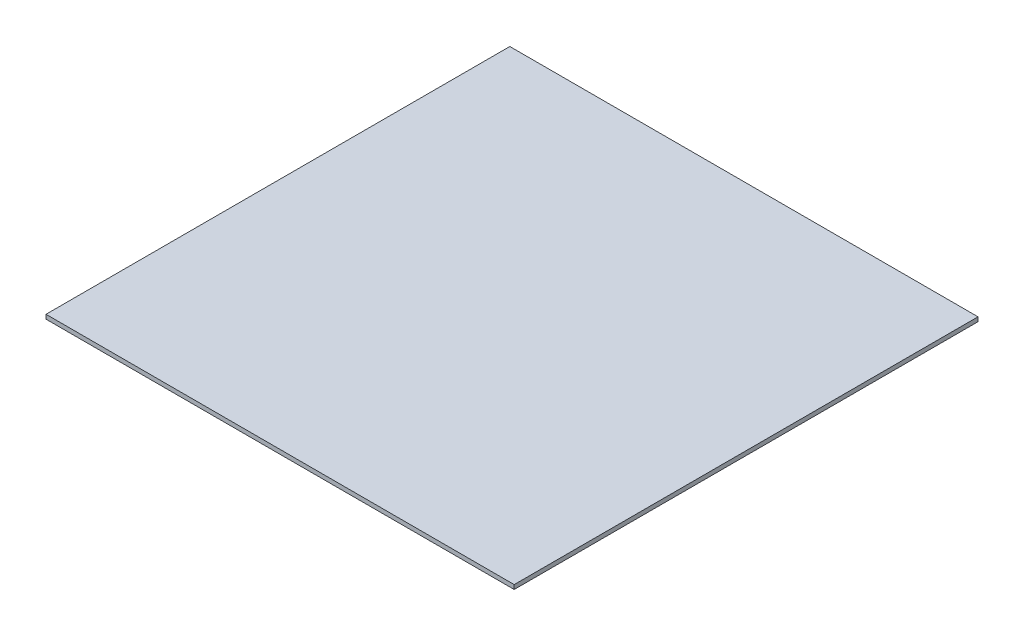
ISO-10303-21;
HEADER;
FILE_DESCRIPTION(('STEP AP214'),'2;1');
FILE_NAME('part.step','',(''),(''),'','','');
FILE_SCHEMA(('AUTOMOTIVE_DESIGN { 1 0 10303 214 1 1 1 1 }'));
ENDSEC;
DATA;
#1=APPLICATION_CONTEXT('core data for automotive mechanical design processes');
#2=APPLICATION_PROTOCOL_DEFINITION('international standard','automotive_design',2000,#1);
#3=PRODUCT_CONTEXT('',#1,'mechanical');
#4=PRODUCT('Part','Part','',(#3));
#5=PRODUCT_RELATED_PRODUCT_CATEGORY('part','',(#4));
#6=PRODUCT_DEFINITION_FORMATION('','',#4);
#7=PRODUCT_DEFINITION_CONTEXT('part definition',#1,'design');
#8=PRODUCT_DEFINITION('design','',#6,#7);
#9=PRODUCT_DEFINITION_SHAPE('','',#8);
#10=(LENGTH_UNIT() NAMED_UNIT(*) SI_UNIT(.MILLI.,.METRE.));
#11=(NAMED_UNIT(*) PLANE_ANGLE_UNIT() SI_UNIT($,.RADIAN.));
#12=(NAMED_UNIT(*) SI_UNIT($,.STERADIAN.) SOLID_ANGLE_UNIT());
#13=UNCERTAINTY_MEASURE_WITH_UNIT(LENGTH_MEASURE(1.E-05),#10,'distance_accuracy_value','');
#14=(GEOMETRIC_REPRESENTATION_CONTEXT(3) GLOBAL_UNCERTAINTY_ASSIGNED_CONTEXT((#13)) GLOBAL_UNIT_ASSIGNED_CONTEXT((#10,
#11,#12)) REPRESENTATION_CONTEXT('',''));
#15=CARTESIAN_POINT('',(0.,0.,0.));
#16=DIRECTION('',(0.,0.,1.));
#17=DIRECTION('',(1.,0.,0.));
#18=AXIS2_PLACEMENT_3D('',#15,#16,#17);
#19=CARTESIAN_POINT('',(304.8,5.55625,301.9425));
#20=DIRECTION('',(-1.,0.,0.));
#21=DIRECTION('',(0.,0.,1.));
#22=AXIS2_PLACEMENT_3D('',#19,#20,#21);
#23=PLANE('',#22);
#24=DIRECTION('',(0.,0.,-1.));
#25=VECTOR('',#24,1.);
#26=CARTESIAN_POINT('',(304.8,0.,301.9425));
#27=LINE('',#26,#25);
#28=CARTESIAN_POINT('',(304.8,0.,301.9425));
#29=VERTEX_POINT('',#28);
#30=CARTESIAN_POINT('',(304.8,0.,-301.9425));
#31=VERTEX_POINT('',#30);
#32=EDGE_CURVE('E103',#29,#31,#27,.T.);
#33=ORIENTED_EDGE('',*,*,#32,.T.);
#34=DIRECTION('',(0.,-1.,0.));
#35=VECTOR('',#34,1.);
#36=CARTESIAN_POINT('',(304.8,5.55625,-301.9425));
#37=LINE('',#36,#35);
#38=CARTESIAN_POINT('',(304.8,5.55625,-301.9425));
#39=VERTEX_POINT('',#38);
#40=EDGE_CURVE('E11',#39,#31,#37,.T.);
#41=ORIENTED_EDGE('',*,*,#40,.F.);
#42=DIRECTION('',(0.,0.,-1.));
#43=VECTOR('',#42,1.);
#44=CARTESIAN_POINT('',(304.8,5.55625,301.9425));
#45=LINE('',#44,#43);
#46=CARTESIAN_POINT('',(304.8,5.55625,301.9425));
#47=VERTEX_POINT('',#46);
#48=EDGE_CURVE('E91',#47,#39,#45,.T.);
#49=ORIENTED_EDGE('',*,*,#48,.F.);
#50=DIRECTION('',(0.,-1.,0.));
#51=VECTOR('',#50,1.);
#52=CARTESIAN_POINT('',(304.8,5.55625,301.9425));
#53=LINE('',#52,#51);
#54=EDGE_CURVE('E99',#47,#29,#53,.T.);
#55=ORIENTED_EDGE('',*,*,#54,.T.);
#56=EDGE_LOOP('',(#33,#41,#49,#55));
#57=FACE_BOUND('',#56,.T.);
#58=ADVANCED_FACE('F40',(#57),#23,.F.);
#59=CARTESIAN_POINT('',(-304.8,5.55625,-301.9425));
#60=DIRECTION('',(0.,0.,1.));
#61=DIRECTION('',(1.,0.,0.));
#62=AXIS2_PLACEMENT_3D('',#59,#60,#61);
#63=PLANE('',#62);
#64=DIRECTION('',(-1.,0.,0.));
#65=VECTOR('',#64,1.);
#66=CARTESIAN_POINT('',(-304.8,0.,-301.9425));
#67=LINE('',#66,#65);
#68=CARTESIAN_POINT('',(-304.8,0.,-301.9425));
#69=VERTEX_POINT('',#68);
#70=EDGE_CURVE('E95',#31,#69,#67,.T.);
#71=ORIENTED_EDGE('',*,*,#70,.T.);
#72=DIRECTION('',(0.,-1.,0.));
#73=VECTOR('',#72,1.);
#74=CARTESIAN_POINT('',(-304.8,5.55625,-301.9425));
#75=LINE('',#74,#73);
#76=CARTESIAN_POINT('',(-304.8,5.55625,-301.9425));
#77=VERTEX_POINT('',#76);
#78=EDGE_CURVE('E48',#77,#69,#75,.T.);
#79=ORIENTED_EDGE('',*,*,#78,.F.);
#80=DIRECTION('',(-1.,0.,0.));
#81=VECTOR('',#80,1.);
#82=CARTESIAN_POINT('',(-304.8,5.55625,-301.9425));
#83=LINE('',#82,#81);
#84=EDGE_CURVE('E86',#39,#77,#83,.T.);
#85=ORIENTED_EDGE('',*,*,#84,.F.);
#86=ORIENTED_EDGE('',*,*,#40,.T.);
#87=EDGE_LOOP('',(#71,#79,#85,#86));
#88=FACE_BOUND('',#87,.T.);
#89=ADVANCED_FACE('F94',(#88),#63,.F.);
#90=CARTESIAN_POINT('',(-304.8,5.55625,301.9425));
#91=DIRECTION('',(1.,0.,0.));
#92=DIRECTION('',(0.,0.,-1.));
#93=AXIS2_PLACEMENT_3D('',#90,#91,#92);
#94=PLANE('',#93);
#95=DIRECTION('',(0.,0.,1.));
#96=VECTOR('',#95,1.);
#97=CARTESIAN_POINT('',(-304.8,0.,301.9425));
#98=LINE('',#97,#96);
#99=CARTESIAN_POINT('',(-304.8,0.,301.9425));
#100=VERTEX_POINT('',#99);
#101=EDGE_CURVE('E73',#69,#100,#98,.T.);
#102=ORIENTED_EDGE('',*,*,#101,.T.);
#103=DIRECTION('',(0.,-1.,0.));
#104=VECTOR('',#103,1.);
#105=CARTESIAN_POINT('',(-304.8,5.55625,301.9425));
#106=LINE('',#105,#104);
#107=CARTESIAN_POINT('',(-304.8,5.55625,301.9425));
#108=VERTEX_POINT('',#107);
#109=EDGE_CURVE('E96',#108,#100,#106,.T.);
#110=ORIENTED_EDGE('',*,*,#109,.F.);
#111=DIRECTION('',(0.,0.,1.));
#112=VECTOR('',#111,1.);
#113=CARTESIAN_POINT('',(-304.8,5.55625,301.9425));
#114=LINE('',#113,#112);
#115=EDGE_CURVE('E89',#77,#108,#114,.T.);
#116=ORIENTED_EDGE('',*,*,#115,.F.);
#117=ORIENTED_EDGE('',*,*,#78,.T.);
#118=EDGE_LOOP('',(#102,#110,#116,#117));
#119=FACE_BOUND('',#118,.T.);
#120=ADVANCED_FACE('F97',(#119),#94,.F.);
#121=CARTESIAN_POINT('',(-304.8,5.55625,301.9425));
#122=DIRECTION('',(0.,0.,-1.));
#123=DIRECTION('',(-1.,0.,0.));
#124=AXIS2_PLACEMENT_3D('',#121,#122,#123);
#125=PLANE('',#124);
#126=DIRECTION('',(1.,0.,0.));
#127=VECTOR('',#126,1.);
#128=CARTESIAN_POINT('',(-304.8,0.,301.9425));
#129=LINE('',#128,#127);
#130=EDGE_CURVE('E79',#100,#29,#129,.T.);
#131=ORIENTED_EDGE('',*,*,#130,.T.);
#132=ORIENTED_EDGE('',*,*,#54,.F.);
#133=DIRECTION('',(1.,0.,0.));
#134=VECTOR('',#133,1.);
#135=CARTESIAN_POINT('',(-304.8,5.55625,301.9425));
#136=LINE('',#135,#134);
#137=EDGE_CURVE('E56',#108,#47,#136,.T.);
#138=ORIENTED_EDGE('',*,*,#137,.F.);
#139=ORIENTED_EDGE('',*,*,#109,.T.);
#140=EDGE_LOOP('',(#131,#132,#138,#139));
#141=FACE_BOUND('',#140,.T.);
#142=ADVANCED_FACE('F110',(#141),#125,.F.);
#143=CARTESIAN_POINT('',(0.,5.55625,0.));
#144=DIRECTION('',(0.,-1.,0.));
#145=DIRECTION('',(0.,0.,-1.));
#146=AXIS2_PLACEMENT_3D('',#143,#144,#145);
#147=PLANE('',#146);
#148=ORIENTED_EDGE('',*,*,#48,.T.);
#149=ORIENTED_EDGE('',*,*,#84,.T.);
#150=ORIENTED_EDGE('',*,*,#115,.T.);
#151=ORIENTED_EDGE('',*,*,#137,.T.);
#152=EDGE_LOOP('',(#148,#149,#150,#151));
#153=FACE_BOUND('',#152,.T.);
#154=ADVANCED_FACE('F87',(#153),#147,.F.);
#155=CARTESIAN_POINT('',(0.,0.,0.));
#156=DIRECTION('',(0.,-1.,0.));
#157=DIRECTION('',(0.,0.,-1.));
#158=AXIS2_PLACEMENT_3D('',#155,#156,#157);
#159=PLANE('',#158);
#160=ORIENTED_EDGE('',*,*,#32,.F.);
#161=ORIENTED_EDGE('',*,*,#130,.F.);
#162=ORIENTED_EDGE('',*,*,#101,.F.);
#163=ORIENTED_EDGE('',*,*,#70,.F.);
#164=EDGE_LOOP('',(#160,#161,#162,#163));
#165=FACE_BOUND('',#164,.T.);
#166=ADVANCED_FACE('F113',(#165),#159,.T.);
#167=CLOSED_SHELL('',(#58,#89,#120,#142,#154,#166));
#168=MANIFOLD_SOLID_BREP('B2',#167);
#169=ADVANCED_BREP_SHAPE_REPRESENTATION('',(#18,#168),#14);
#170=SHAPE_DEFINITION_REPRESENTATION(#9,#169);
ENDSEC;
END-ISO-10303-21;
